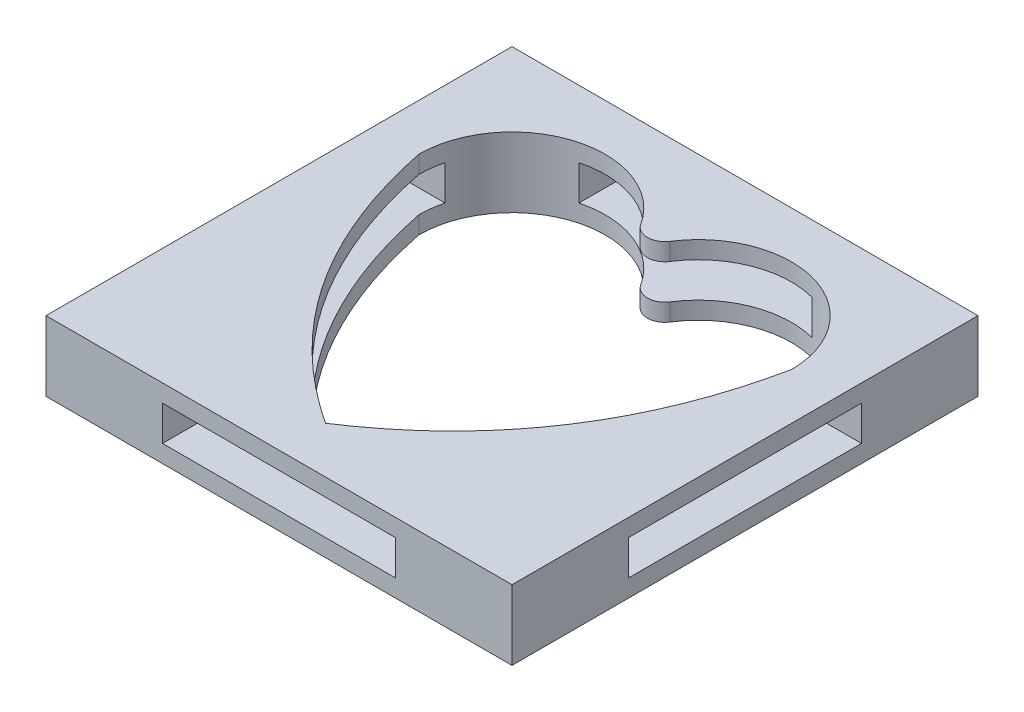
ISO-10303-21;
HEADER;
FILE_DESCRIPTION(('STEP AP214'),'2;1');
FILE_NAME('part.step','',(''),(''),'','','');
FILE_SCHEMA(('AUTOMOTIVE_DESIGN { 1 0 10303 214 1 1 1 1 }'));
ENDSEC;
DATA;
#1=APPLICATION_CONTEXT('core data for automotive mechanical design processes');
#2=APPLICATION_PROTOCOL_DEFINITION('international standard','automotive_design',2000,#1);
#3=PRODUCT_CONTEXT('',#1,'mechanical');
#4=PRODUCT('Part','Part','',(#3));
#5=PRODUCT_RELATED_PRODUCT_CATEGORY('part','',(#4));
#6=PRODUCT_DEFINITION_FORMATION('','',#4);
#7=PRODUCT_DEFINITION_CONTEXT('part definition',#1,'design');
#8=PRODUCT_DEFINITION('design','',#6,#7);
#9=PRODUCT_DEFINITION_SHAPE('','',#8);
#10=(LENGTH_UNIT() NAMED_UNIT(*) SI_UNIT(.MILLI.,.METRE.));
#11=(NAMED_UNIT(*) PLANE_ANGLE_UNIT() SI_UNIT($,.RADIAN.));
#12=(NAMED_UNIT(*) SI_UNIT($,.STERADIAN.) SOLID_ANGLE_UNIT());
#13=UNCERTAINTY_MEASURE_WITH_UNIT(LENGTH_MEASURE(1.E-05),#10,'distance_accuracy_value','');
#14=(GEOMETRIC_REPRESENTATION_CONTEXT(3) GLOBAL_UNCERTAINTY_ASSIGNED_CONTEXT((#13)) GLOBAL_UNIT_ASSIGNED_CONTEXT((#10,
#11,#12)) REPRESENTATION_CONTEXT('',''));
#15=CARTESIAN_POINT('',(0.,0.,0.));
#16=DIRECTION('',(0.,0.,1.));
#17=DIRECTION('',(1.,0.,0.));
#18=AXIS2_PLACEMENT_3D('',#15,#16,#17);
#19=CARTESIAN_POINT('',(0.,3.,-6.5617376914899));
#20=DIRECTION('',(0.,-1.,0.));
#21=DIRECTION('',(0.,0.,-1.));
#22=AXIS2_PLACEMENT_3D('',#19,#20,#21);
#23=CYLINDRICAL_SURFACE('',#22,0.75);
#24=CARTESIAN_POINT('',(0.,2.25,-6.5617376914899));
#25=DIRECTION('',(0.,1.,0.));
#26=DIRECTION('',(0.,0.,1.));
#27=AXIS2_PLACEMENT_3D('',#24,#25,#26);
#28=CIRCLE('',#27,0.75);
#29=CARTESIAN_POINT('',(0.631578947368423,2.25,-6.1572527928336));
#30=VERTEX_POINT('',#29);
#31=CARTESIAN_POINT('',(-0.631578947368421,2.25,-6.1572527928336));
#32=VERTEX_POINT('',#31);
#33=EDGE_CURVE('E302',#30,#32,#28,.F.);
#34=ORIENTED_EDGE('',*,*,#33,.F.);
#35=DIRECTION('',(0.,-1.,0.));
#36=VECTOR('',#35,1.);
#37=CARTESIAN_POINT('',(0.631578947368423,3.,-6.1572527928336));
#38=LINE('',#37,#36);
#39=CARTESIAN_POINT('',(0.631578947368423,3.,-6.1572527928336));
#40=VERTEX_POINT('',#39);
#41=EDGE_CURVE('E476',#40,#30,#38,.T.);
#42=ORIENTED_EDGE('',*,*,#41,.F.);
#43=CARTESIAN_POINT('',(0.,3.,-6.5617376914899));
#44=DIRECTION('',(0.,-1.,0.));
#45=DIRECTION('',(0.,0.,1.));
#46=AXIS2_PLACEMENT_3D('',#43,#44,#45);
#47=CIRCLE('',#46,0.75);
#48=CARTESIAN_POINT('',(-0.631578947368419,3.,-6.1572527928336));
#49=VERTEX_POINT('',#48);
#50=EDGE_CURVE('E405',#40,#49,#47,.T.);
#51=ORIENTED_EDGE('',*,*,#50,.T.);
#52=DIRECTION('',(0.,-1.,0.));
#53=VECTOR('',#52,1.);
#54=CARTESIAN_POINT('',(-0.631578947368419,3.,-6.1572527928336));
#55=LINE('',#54,#53);
#56=EDGE_CURVE('E479',#49,#32,#55,.T.);
#57=ORIENTED_EDGE('',*,*,#56,.T.);
#58=EDGE_LOOP('',(#34,#42,#51,#57));
#59=FACE_BOUND('',#58,.T.);
#60=ADVANCED_FACE('F39',(#59),#23,.T.);
#61=CARTESIAN_POINT('',(-8.,3.,-4.));
#62=CARTESIAN_POINT('',(-6.40333694662844,3.,3.8115441038304));
#63=CARTESIAN_POINT('',(0.,3.,8.));
#64=B_SPLINE_CURVE_WITH_KNOTS('',2,(#61,#62,#63),.UNSPECIFIED.,.F.,.F.,(3,3),(0.,1.),.UNSPECIFIED.);
#65=DIRECTION('',(0.,-1.,0.));
#66=VECTOR('',#65,1.);
#67=SURFACE_OF_LINEAR_EXTRUSION('',#64,#66);
#68=DIRECTION('',(0.,-1.,0.));
#69=VECTOR('',#68,1.);
#70=CARTESIAN_POINT('',(0.,3.,8.));
#71=LINE('',#70,#69);
#72=CARTESIAN_POINT('',(0.,3.,8.));
#73=VERTEX_POINT('',#72);
#74=CARTESIAN_POINT('',(0.,2.25,8.));
#75=VERTEX_POINT('',#74);
#76=EDGE_CURVE('E502',#73,#75,#71,.T.);
#77=ORIENTED_EDGE('',*,*,#76,.T.);
#78=CARTESIAN_POINT('',(-8.,2.25,-4.));
#79=CARTESIAN_POINT('',(-6.40333694662844,2.25,3.8115441038304));
#80=CARTESIAN_POINT('',(0.,2.25,8.));
#81=B_SPLINE_CURVE_WITH_KNOTS('',2,(#78,#79,#80),.UNSPECIFIED.,.F.,.F.,(3,3),(0.,1.),.UNSPECIFIED.);
#82=CARTESIAN_POINT('',(-8.,2.25,-4.));
#83=VERTEX_POINT('',#82);
#84=EDGE_CURVE('E367',#83,#75,#81,.T.);
#85=ORIENTED_EDGE('',*,*,#84,.F.);
#86=DIRECTION('',(0.,-1.,0.));
#87=VECTOR('',#86,1.);
#88=CARTESIAN_POINT('',(-8.,3.,-4.));
#89=LINE('',#88,#87);
#90=CARTESIAN_POINT('',(-8.,3.,-4.));
#91=VERTEX_POINT('',#90);
#92=EDGE_CURVE('E507',#91,#83,#89,.T.);
#93=ORIENTED_EDGE('',*,*,#92,.F.);
#94=EDGE_CURVE('E412',#91,#73,#64,.T.);
#95=ORIENTED_EDGE('',*,*,#94,.T.);
#96=EDGE_LOOP('',(#77,#85,#93,#95));
#97=FACE_BOUND('',#96,.T.);
#98=ADVANCED_FACE('F434',(#97),#67,.T.);
#99=CARTESIAN_POINT('',(0.,3.,8.));
#100=CARTESIAN_POINT('',(6.40333694662844,3.,3.81154410383039));
#101=CARTESIAN_POINT('',(8.,3.,-4.));
#102=B_SPLINE_CURVE_WITH_KNOTS('',2,(#99,#100,#101),.UNSPECIFIED.,.F.,.F.,(3,3),(0.,1.),.UNSPECIFIED.);
#103=DIRECTION('',(0.,-1.,0.));
#104=VECTOR('',#103,1.);
#105=SURFACE_OF_LINEAR_EXTRUSION('',#102,#104);
#106=CARTESIAN_POINT('',(0.,2.25,8.));
#107=CARTESIAN_POINT('',(6.40333694662844,2.25,3.81154410383039));
#108=CARTESIAN_POINT('',(8.,2.25,-4.));
#109=B_SPLINE_CURVE_WITH_KNOTS('',2,(#106,#107,#108),.UNSPECIFIED.,.F.,.F.,(3,3),(0.,1.),.UNSPECIFIED.);
#110=CARTESIAN_POINT('',(8.,2.25,-4.));
#111=VERTEX_POINT('',#110);
#112=EDGE_CURVE('E347',#75,#111,#109,.T.);
#113=ORIENTED_EDGE('',*,*,#112,.F.);
#114=ORIENTED_EDGE('',*,*,#76,.F.);
#115=CARTESIAN_POINT('',(8.,3.,-4.));
#116=VERTEX_POINT('',#115);
#117=EDGE_CURVE('E418',#73,#116,#102,.T.);
#118=ORIENTED_EDGE('',*,*,#117,.T.);
#119=DIRECTION('',(0.,-1.,0.));
#120=VECTOR('',#119,1.);
#121=CARTESIAN_POINT('',(8.,3.,-4.));
#122=LINE('',#121,#120);
#123=EDGE_CURVE('E494',#116,#111,#122,.T.);
#124=ORIENTED_EDGE('',*,*,#123,.T.);
#125=EDGE_LOOP('',(#113,#114,#118,#124));
#126=FACE_BOUND('',#125,.T.);
#127=ADVANCED_FACE('F447',(#126),#105,.T.);
#128=CARTESIAN_POINT('',(0.,3.,0.));
#129=DIRECTION('',(0.,1.,0.));
#130=DIRECTION('',(0.,0.,1.));
#131=AXIS2_PLACEMENT_3D('',#128,#129,#130);
#132=PLANE('',#131);
#133=DIRECTION('',(0.,0.,1.));
#134=VECTOR('',#133,1.);
#135=CARTESIAN_POINT('',(-10.,3.,10.));
#136=LINE('',#135,#134);
#137=CARTESIAN_POINT('',(-10.,3.,-10.));
#138=VERTEX_POINT('',#137);
#139=CARTESIAN_POINT('',(-10.,3.,10.));
#140=VERTEX_POINT('',#139);
#141=EDGE_CURVE('E515',#138,#140,#136,.T.);
#142=ORIENTED_EDGE('',*,*,#141,.T.);
#143=DIRECTION('',(1.,0.,0.));
#144=VECTOR('',#143,1.);
#145=CARTESIAN_POINT('',(10.,3.,10.));
#146=LINE('',#145,#144);
#147=CARTESIAN_POINT('',(10.,3.,10.));
#148=VERTEX_POINT('',#147);
#149=EDGE_CURVE('E519',#140,#148,#146,.T.);
#150=ORIENTED_EDGE('',*,*,#149,.T.);
#151=DIRECTION('',(0.,0.,-1.));
#152=VECTOR('',#151,1.);
#153=CARTESIAN_POINT('',(10.,3.,10.));
#154=LINE('',#153,#152);
#155=CARTESIAN_POINT('',(10.,3.,-10.));
#156=VERTEX_POINT('',#155);
#157=EDGE_CURVE('E523',#148,#156,#154,.T.);
#158=ORIENTED_EDGE('',*,*,#157,.T.);
#159=DIRECTION('',(-1.,0.,0.));
#160=VECTOR('',#159,1.);
#161=CARTESIAN_POINT('',(10.,3.,-10.));
#162=LINE('',#161,#160);
#163=EDGE_CURVE('E526',#156,#138,#162,.T.);
#164=ORIENTED_EDGE('',*,*,#163,.T.);
#165=EDGE_LOOP('',(#142,#150,#158,#164));
#166=FACE_BOUND('',#165,.T.);
#167=CARTESIAN_POINT('',(-4.,3.,-4.));
#168=DIRECTION('',(0.,1.,0.));
#169=DIRECTION('',(0.,0.,1.));
#170=AXIS2_PLACEMENT_3D('',#167,#168,#169);
#171=CIRCLE('',#170,4.);
#172=EDGE_CURVE('E408',#49,#91,#171,.T.);
#173=ORIENTED_EDGE('',*,*,#172,.F.);
#174=ORIENTED_EDGE('',*,*,#50,.F.);
#175=CARTESIAN_POINT('',(4.,3.,-4.));
#176=DIRECTION('',(0.,1.,0.));
#177=DIRECTION('',(0.,0.,1.));
#178=AXIS2_PLACEMENT_3D('',#175,#176,#177);
#179=CIRCLE('',#178,4.);
#180=EDGE_CURVE('E487',#116,#40,#179,.T.);
#181=ORIENTED_EDGE('',*,*,#180,.F.);
#182=ORIENTED_EDGE('',*,*,#117,.F.);
#183=ORIENTED_EDGE('',*,*,#94,.F.);
#184=EDGE_LOOP('',(#173,#174,#181,#182,#183));
#185=FACE_BOUND('',#184,.T.);
#186=ADVANCED_FACE('F443',(#166,#185),#132,.T.);
#187=CARTESIAN_POINT('',(0.,0.,0.));
#188=DIRECTION('',(0.,1.,0.));
#189=DIRECTION('',(0.,0.,1.));
#190=AXIS2_PLACEMENT_3D('',#187,#188,#189);
#191=PLANE('',#190);
#192=DIRECTION('',(0.,0.,1.));
#193=VECTOR('',#192,1.);
#194=CARTESIAN_POINT('',(-10.,0.,10.));
#195=LINE('',#194,#193);
#196=CARTESIAN_POINT('',(-10.,0.,-10.));
#197=VERTEX_POINT('',#196);
#198=CARTESIAN_POINT('',(-10.,0.,10.));
#199=VERTEX_POINT('',#198);
#200=EDGE_CURVE('E514',#197,#199,#195,.T.);
#201=ORIENTED_EDGE('',*,*,#200,.F.);
#202=DIRECTION('',(-1.,0.,0.));
#203=VECTOR('',#202,1.);
#204=CARTESIAN_POINT('',(10.,0.,-10.));
#205=LINE('',#204,#203);
#206=CARTESIAN_POINT('',(10.,0.,-10.));
#207=VERTEX_POINT('',#206);
#208=EDGE_CURVE('E520',#207,#197,#205,.T.);
#209=ORIENTED_EDGE('',*,*,#208,.F.);
#210=DIRECTION('',(0.,0.,-1.));
#211=VECTOR('',#210,1.);
#212=CARTESIAN_POINT('',(10.,0.,10.));
#213=LINE('',#212,#211);
#214=CARTESIAN_POINT('',(10.,0.,10.));
#215=VERTEX_POINT('',#214);
#216=EDGE_CURVE('E536',#215,#207,#213,.T.);
#217=ORIENTED_EDGE('',*,*,#216,.F.);
#218=DIRECTION('',(1.,0.,0.));
#219=VECTOR('',#218,1.);
#220=CARTESIAN_POINT('',(10.,0.,10.));
#221=LINE('',#220,#219);
#222=EDGE_CURVE('E533',#199,#215,#221,.T.);
#223=ORIENTED_EDGE('',*,*,#222,.F.);
#224=EDGE_LOOP('',(#201,#209,#217,#223));
#225=FACE_BOUND('',#224,.T.);
#226=CARTESIAN_POINT('',(0.,0.,-6.5617376914899));
#227=DIRECTION('',(0.,-1.,0.));
#228=DIRECTION('',(0.,0.,1.));
#229=AXIS2_PLACEMENT_3D('',#226,#227,#228);
#230=CIRCLE('',#229,0.75);
#231=CARTESIAN_POINT('',(0.631578947368423,0.,-6.1572527928336));
#232=VERTEX_POINT('',#231);
#233=CARTESIAN_POINT('',(-0.631578947368419,0.,-6.1572527928336));
#234=VERTEX_POINT('',#233);
#235=EDGE_CURVE('E404',#232,#234,#230,.T.);
#236=ORIENTED_EDGE('',*,*,#235,.T.);
#237=CARTESIAN_POINT('',(-4.,0.,-4.));
#238=DIRECTION('',(0.,1.,0.));
#239=DIRECTION('',(0.,0.,1.));
#240=AXIS2_PLACEMENT_3D('',#237,#238,#239);
#241=CIRCLE('',#240,4.);
#242=CARTESIAN_POINT('',(-8.,0.,-4.));
#243=VERTEX_POINT('',#242);
#244=EDGE_CURVE('E589',#234,#243,#241,.T.);
#245=ORIENTED_EDGE('',*,*,#244,.T.);
#246=CARTESIAN_POINT('',(-8.,0.,-4.));
#247=CARTESIAN_POINT('',(-6.40333694662844,0.,3.8115441038304));
#248=CARTESIAN_POINT('',(0.,0.,8.));
#249=B_SPLINE_CURVE_WITH_KNOTS('',2,(#246,#247,#248),.UNSPECIFIED.,.F.,.F.,(3,3),(0.,1.),.UNSPECIFIED.);
#250=CARTESIAN_POINT('',(0.,0.,8.));
#251=VERTEX_POINT('',#250);
#252=EDGE_CURVE('E586',#243,#251,#249,.T.);
#253=ORIENTED_EDGE('',*,*,#252,.T.);
#254=CARTESIAN_POINT('',(0.,0.,8.));
#255=CARTESIAN_POINT('',(6.40333694662844,0.,3.81154410383039));
#256=CARTESIAN_POINT('',(8.,0.,-4.));
#257=B_SPLINE_CURVE_WITH_KNOTS('',2,(#254,#255,#256),.UNSPECIFIED.,.F.,.F.,(3,3),(0.,1.),.UNSPECIFIED.);
#258=CARTESIAN_POINT('',(8.,0.,-4.));
#259=VERTEX_POINT('',#258);
#260=EDGE_CURVE('E582',#251,#259,#257,.T.);
#261=ORIENTED_EDGE('',*,*,#260,.T.);
#262=CARTESIAN_POINT('',(4.,0.,-4.));
#263=DIRECTION('',(0.,1.,0.));
#264=DIRECTION('',(0.,0.,1.));
#265=AXIS2_PLACEMENT_3D('',#262,#263,#264);
#266=CIRCLE('',#265,4.);
#267=EDGE_CURVE('E409',#259,#232,#266,.T.);
#268=ORIENTED_EDGE('',*,*,#267,.T.);
#269=EDGE_LOOP('',(#236,#245,#253,#261,#268));
#270=FACE_BOUND('',#269,.T.);
#271=ADVANCED_FACE('F446',(#225,#270),#191,.F.);
#272=CARTESIAN_POINT('',(-10.,3.,10.));
#273=DIRECTION('',(1.,0.,0.));
#274=DIRECTION('',(0.,0.,-1.));
#275=AXIS2_PLACEMENT_3D('',#272,#273,#274);
#276=PLANE('',#275);
#277=DIRECTION('',(0.,0.,-1.));
#278=VECTOR('',#277,1.);
#279=CARTESIAN_POINT('',(-10.,0.75,5.));
#280=LINE('',#279,#278);
#281=CARTESIAN_POINT('',(-10.,0.75,5.));
#282=VERTEX_POINT('',#281);
#283=CARTESIAN_POINT('',(-10.,0.75,-5.));
#284=VERTEX_POINT('',#283);
#285=EDGE_CURVE('E325',#282,#284,#280,.T.);
#286=ORIENTED_EDGE('',*,*,#285,.T.);
#287=DIRECTION('',(0.,1.,0.));
#288=VECTOR('',#287,1.);
#289=CARTESIAN_POINT('',(-10.,2.25,-5.));
#290=LINE('',#289,#288);
#291=CARTESIAN_POINT('',(-10.,2.25,-5.));
#292=VERTEX_POINT('',#291);
#293=EDGE_CURVE('E312',#284,#292,#290,.T.);
#294=ORIENTED_EDGE('',*,*,#293,.T.);
#295=DIRECTION('',(0.,0.,1.));
#296=VECTOR('',#295,1.);
#297=CARTESIAN_POINT('',(-10.,2.25,5.));
#298=LINE('',#297,#296);
#299=CARTESIAN_POINT('',(-10.,2.25,5.));
#300=VERTEX_POINT('',#299);
#301=EDGE_CURVE('E316',#292,#300,#298,.T.);
#302=ORIENTED_EDGE('',*,*,#301,.T.);
#303=DIRECTION('',(0.,-1.,0.));
#304=VECTOR('',#303,1.);
#305=CARTESIAN_POINT('',(-10.,2.25,5.));
#306=LINE('',#305,#304);
#307=EDGE_CURVE('E321',#300,#282,#306,.T.);
#308=ORIENTED_EDGE('',*,*,#307,.T.);
#309=EDGE_LOOP('',(#286,#294,#302,#308));
#310=FACE_BOUND('',#309,.T.);
#311=ORIENTED_EDGE('',*,*,#200,.T.);
#312=DIRECTION('',(0.,-1.,0.));
#313=VECTOR('',#312,1.);
#314=CARTESIAN_POINT('',(-10.,3.,10.));
#315=LINE('',#314,#313);
#316=EDGE_CURVE('E552',#140,#199,#315,.T.);
#317=ORIENTED_EDGE('',*,*,#316,.F.);
#318=ORIENTED_EDGE('',*,*,#141,.F.);
#319=DIRECTION('',(0.,-1.,0.));
#320=VECTOR('',#319,1.);
#321=CARTESIAN_POINT('',(-10.,3.,-10.));
#322=LINE('',#321,#320);
#323=EDGE_CURVE('E529',#138,#197,#322,.T.);
#324=ORIENTED_EDGE('',*,*,#323,.T.);
#325=EDGE_LOOP('',(#311,#317,#318,#324));
#326=FACE_BOUND('',#325,.T.);
#327=ADVANCED_FACE('F41',(#310,#326),#276,.F.);
#328=CARTESIAN_POINT('',(10.,3.,10.));
#329=DIRECTION('',(0.,0.,-1.));
#330=DIRECTION('',(-1.,0.,0.));
#331=AXIS2_PLACEMENT_3D('',#328,#329,#330);
#332=PLANE('',#331);
#333=DIRECTION('',(1.,0.,0.));
#334=VECTOR('',#333,1.);
#335=CARTESIAN_POINT('',(5.,0.75,10.));
#336=LINE('',#335,#334);
#337=CARTESIAN_POINT('',(-5.,0.75,10.));
#338=VERTEX_POINT('',#337);
#339=CARTESIAN_POINT('',(5.,0.75,10.));
#340=VERTEX_POINT('',#339);
#341=EDGE_CURVE('E266',#338,#340,#336,.T.);
#342=ORIENTED_EDGE('',*,*,#341,.F.);
#343=DIRECTION('',(0.,-1.,0.));
#344=VECTOR('',#343,1.);
#345=CARTESIAN_POINT('',(-5.,0.75,10.));
#346=LINE('',#345,#344);
#347=CARTESIAN_POINT('',(-5.,2.25,10.));
#348=VERTEX_POINT('',#347);
#349=EDGE_CURVE('E55',#348,#338,#346,.T.);
#350=ORIENTED_EDGE('',*,*,#349,.F.);
#351=DIRECTION('',(-1.,0.,0.));
#352=VECTOR('',#351,1.);
#353=CARTESIAN_POINT('',(5.,2.25,10.));
#354=LINE('',#353,#352);
#355=CARTESIAN_POINT('',(5.,2.25,10.));
#356=VERTEX_POINT('',#355);
#357=EDGE_CURVE('E253',#356,#348,#354,.T.);
#358=ORIENTED_EDGE('',*,*,#357,.F.);
#359=DIRECTION('',(0.,1.,0.));
#360=VECTOR('',#359,1.);
#361=CARTESIAN_POINT('',(5.,0.75,10.));
#362=LINE('',#361,#360);
#363=EDGE_CURVE('E257',#340,#356,#362,.T.);
#364=ORIENTED_EDGE('',*,*,#363,.F.);
#365=EDGE_LOOP('',(#342,#350,#358,#364));
#366=FACE_BOUND('',#365,.T.);
#367=ORIENTED_EDGE('',*,*,#222,.T.);
#368=DIRECTION('',(0.,-1.,0.));
#369=VECTOR('',#368,1.);
#370=CARTESIAN_POINT('',(10.,3.,10.));
#371=LINE('',#370,#369);
#372=EDGE_CURVE('E548',#148,#215,#371,.T.);
#373=ORIENTED_EDGE('',*,*,#372,.F.);
#374=ORIENTED_EDGE('',*,*,#149,.F.);
#375=ORIENTED_EDGE('',*,*,#316,.T.);
#376=EDGE_LOOP('',(#367,#373,#374,#375));
#377=FACE_BOUND('',#376,.T.);
#378=ADVANCED_FACE('F456',(#366,#377),#332,.F.);
#379=CARTESIAN_POINT('',(10.,3.,10.));
#380=DIRECTION('',(-1.,0.,0.));
#381=DIRECTION('',(0.,0.,1.));
#382=AXIS2_PLACEMENT_3D('',#379,#380,#381);
#383=PLANE('',#382);
#384=DIRECTION('',(0.,0.,1.));
#385=VECTOR('',#384,1.);
#386=CARTESIAN_POINT('',(10.,2.25,5.));
#387=LINE('',#386,#385);
#388=CARTESIAN_POINT('',(10.,2.25,-5.));
#389=VERTEX_POINT('',#388);
#390=CARTESIAN_POINT('',(10.,2.25,5.));
#391=VERTEX_POINT('',#390);
#392=EDGE_CURVE('E332',#389,#391,#387,.T.);
#393=ORIENTED_EDGE('',*,*,#392,.F.);
#394=DIRECTION('',(0.,1.,0.));
#395=VECTOR('',#394,1.);
#396=CARTESIAN_POINT('',(10.,2.25,-5.));
#397=LINE('',#396,#395);
#398=CARTESIAN_POINT('',(10.,0.75,-5.));
#399=VERTEX_POINT('',#398);
#400=EDGE_CURVE('E311',#399,#389,#397,.T.);
#401=ORIENTED_EDGE('',*,*,#400,.F.);
#402=DIRECTION('',(0.,0.,-1.));
#403=VECTOR('',#402,1.);
#404=CARTESIAN_POINT('',(10.,0.75,5.));
#405=LINE('',#404,#403);
#406=CARTESIAN_POINT('',(10.,0.75,5.));
#407=VERTEX_POINT('',#406);
#408=EDGE_CURVE('E317',#407,#399,#405,.T.);
#409=ORIENTED_EDGE('',*,*,#408,.F.);
#410=DIRECTION('',(0.,-1.,0.));
#411=VECTOR('',#410,1.);
#412=CARTESIAN_POINT('',(10.,2.25,5.));
#413=LINE('',#412,#411);
#414=EDGE_CURVE('E336',#391,#407,#413,.T.);
#415=ORIENTED_EDGE('',*,*,#414,.F.);
#416=EDGE_LOOP('',(#393,#401,#409,#415));
#417=FACE_BOUND('',#416,.T.);
#418=ORIENTED_EDGE('',*,*,#216,.T.);
#419=DIRECTION('',(0.,-1.,0.));
#420=VECTOR('',#419,1.);
#421=CARTESIAN_POINT('',(10.,3.,-10.));
#422=LINE('',#421,#420);
#423=EDGE_CURVE('E544',#156,#207,#422,.T.);
#424=ORIENTED_EDGE('',*,*,#423,.F.);
#425=ORIENTED_EDGE('',*,*,#157,.F.);
#426=ORIENTED_EDGE('',*,*,#372,.T.);
#427=EDGE_LOOP('',(#418,#424,#425,#426));
#428=FACE_BOUND('',#427,.T.);
#429=ADVANCED_FACE('F454',(#417,#428),#383,.F.);
#430=CARTESIAN_POINT('',(10.,3.,-10.));
#431=DIRECTION('',(0.,0.,1.));
#432=DIRECTION('',(1.,0.,0.));
#433=AXIS2_PLACEMENT_3D('',#430,#431,#432);
#434=PLANE('',#433);
#435=DIRECTION('',(-1.,0.,0.));
#436=VECTOR('',#435,1.);
#437=CARTESIAN_POINT('',(5.,2.25,-10.));
#438=LINE('',#437,#436);
#439=CARTESIAN_POINT('',(5.,2.25,-10.));
#440=VERTEX_POINT('',#439);
#441=CARTESIAN_POINT('',(-5.,2.25,-10.));
#442=VERTEX_POINT('',#441);
#443=EDGE_CURVE('E251',#440,#442,#438,.T.);
#444=ORIENTED_EDGE('',*,*,#443,.T.);
#445=DIRECTION('',(0.,-1.,0.));
#446=VECTOR('',#445,1.);
#447=CARTESIAN_POINT('',(-5.,0.75,-10.));
#448=LINE('',#447,#446);
#449=CARTESIAN_POINT('',(-5.,0.75,-10.));
#450=VERTEX_POINT('',#449);
#451=EDGE_CURVE('E231',#442,#450,#448,.T.);
#452=ORIENTED_EDGE('',*,*,#451,.T.);
#453=DIRECTION('',(1.,0.,0.));
#454=VECTOR('',#453,1.);
#455=CARTESIAN_POINT('',(5.,0.75,-10.));
#456=LINE('',#455,#454);
#457=CARTESIAN_POINT('',(5.,0.75,-10.));
#458=VERTEX_POINT('',#457);
#459=EDGE_CURVE('E242',#450,#458,#456,.T.);
#460=ORIENTED_EDGE('',*,*,#459,.T.);
#461=DIRECTION('',(0.,1.,0.));
#462=VECTOR('',#461,1.);
#463=CARTESIAN_POINT('',(5.,0.75,-10.));
#464=LINE('',#463,#462);
#465=EDGE_CURVE('E63',#458,#440,#464,.T.);
#466=ORIENTED_EDGE('',*,*,#465,.T.);
#467=EDGE_LOOP('',(#444,#452,#460,#466));
#468=FACE_BOUND('',#467,.T.);
#469=ORIENTED_EDGE('',*,*,#208,.T.);
#470=ORIENTED_EDGE('',*,*,#323,.F.);
#471=ORIENTED_EDGE('',*,*,#163,.F.);
#472=ORIENTED_EDGE('',*,*,#423,.T.);
#473=EDGE_LOOP('',(#469,#470,#471,#472));
#474=FACE_BOUND('',#473,.T.);
#475=ADVANCED_FACE('F248',(#468,#474),#434,.F.);
#476=CARTESIAN_POINT('',(0.,0.75,-6.5617376914899));
#477=DIRECTION('',(0.,-1.,0.));
#478=DIRECTION('',(1.,0.,0.));
#479=AXIS2_PLACEMENT_3D('',#476,#477,#478);
#480=CIRCLE('',#479,0.75);
#481=CARTESIAN_POINT('',(-0.631578947368421,0.75,-6.1572527928336));
#482=VERTEX_POINT('',#481);
#483=CARTESIAN_POINT('',(0.631578947368423,0.75,-6.1572527928336));
#484=VERTEX_POINT('',#483);
#485=EDGE_CURVE('E293',#482,#484,#480,.F.);
#486=ORIENTED_EDGE('',*,*,#485,.F.);
#487=EDGE_CURVE('E511',#482,#234,#55,.T.);
#488=ORIENTED_EDGE('',*,*,#487,.T.);
#489=ORIENTED_EDGE('',*,*,#235,.F.);
#490=EDGE_CURVE('E490',#484,#232,#38,.T.);
#491=ORIENTED_EDGE('',*,*,#490,.F.);
#492=EDGE_LOOP('',(#486,#488,#489,#491));
#493=FACE_BOUND('',#492,.T.);
#494=ADVANCED_FACE('F438',(#493),#23,.T.);
#495=CARTESIAN_POINT('',(-4.,3.,-4.));
#496=DIRECTION('',(0.,-1.,0.));
#497=DIRECTION('',(0.,0.,-1.));
#498=AXIS2_PLACEMENT_3D('',#495,#496,#497);
#499=CYLINDRICAL_SURFACE('',#498,4.);
#500=CARTESIAN_POINT('',(-4.,2.25,-4.));
#501=DIRECTION('',(0.,1.,0.));
#502=DIRECTION('',(0.,0.,1.));
#503=AXIS2_PLACEMENT_3D('',#500,#501,#502);
#504=CIRCLE('',#503,4.);
#505=CARTESIAN_POINT('',(-5.,2.25,-7.87298334620742));
#506=VERTEX_POINT('',#505);
#507=EDGE_CURVE('E305',#32,#506,#504,.T.);
#508=ORIENTED_EDGE('',*,*,#507,.F.);
#509=ORIENTED_EDGE('',*,*,#56,.F.);
#510=ORIENTED_EDGE('',*,*,#172,.T.);
#511=ORIENTED_EDGE('',*,*,#92,.T.);
#512=CARTESIAN_POINT('',(-4.,2.25,-4.));
#513=DIRECTION('',(0.,1.,0.));
#514=DIRECTION('',(0.,0.,1.));
#515=AXIS2_PLACEMENT_3D('',#512,#513,#514);
#516=CIRCLE('',#515,4.);
#517=CARTESIAN_POINT('',(-7.87298334620742,2.25,-5.));
#518=VERTEX_POINT('',#517);
#519=EDGE_CURVE('E376',#518,#83,#516,.T.);
#520=ORIENTED_EDGE('',*,*,#519,.F.);
#521=DIRECTION('',(0.,-1.,0.));
#522=VECTOR('',#521,1.);
#523=CARTESIAN_POINT('',(-7.87298334620742,3.,-5.));
#524=LINE('',#523,#522);
#525=CARTESIAN_POINT('',(-7.87298334620742,0.75,-5.));
#526=VERTEX_POINT('',#525);
#527=EDGE_CURVE('E401',#526,#518,#524,.F.);
#528=ORIENTED_EDGE('',*,*,#527,.F.);
#529=CARTESIAN_POINT('',(-4.,0.75,-4.));
#530=DIRECTION('',(0.,-1.,0.));
#531=DIRECTION('',(0.,0.,-1.));
#532=AXIS2_PLACEMENT_3D('',#529,#530,#531);
#533=CIRCLE('',#532,4.);
#534=CARTESIAN_POINT('',(-8.,0.75,-4.));
#535=VERTEX_POINT('',#534);
#536=EDGE_CURVE('E395',#535,#526,#533,.T.);
#537=ORIENTED_EDGE('',*,*,#536,.F.);
#538=EDGE_CURVE('E506',#535,#243,#89,.T.);
#539=ORIENTED_EDGE('',*,*,#538,.T.);
#540=ORIENTED_EDGE('',*,*,#244,.F.);
#541=ORIENTED_EDGE('',*,*,#487,.F.);
#542=CARTESIAN_POINT('',(-4.,0.75,-4.));
#543=DIRECTION('',(0.,-1.,0.));
#544=DIRECTION('',(1.,0.,0.));
#545=AXIS2_PLACEMENT_3D('',#542,#543,#544);
#546=CIRCLE('',#545,4.);
#547=CARTESIAN_POINT('',(-5.,0.75,-7.87298334620742));
#548=VERTEX_POINT('',#547);
#549=EDGE_CURVE('E296',#548,#482,#546,.T.);
#550=ORIENTED_EDGE('',*,*,#549,.F.);
#551=DIRECTION('',(0.,-1.,0.));
#552=VECTOR('',#551,1.);
#553=CARTESIAN_POINT('',(-5.,3.,-7.87298334620742));
#554=LINE('',#553,#552);
#555=EDGE_CURVE('E234',#506,#548,#554,.T.);
#556=ORIENTED_EDGE('',*,*,#555,.F.);
#557=EDGE_LOOP('',(#508,#509,#510,#511,#520,#528,#537,#539,#540,#541,#550,#556));
#558=FACE_BOUND('',#557,.T.);
#559=ADVANCED_FACE('F432',(#558),#499,.F.);
#560=CARTESIAN_POINT('',(-8.,0.75,-4.));
#561=CARTESIAN_POINT('',(-6.40333694662844,0.75,3.8115441038304));
#562=CARTESIAN_POINT('',(0.,0.75,8.));
#563=B_SPLINE_CURVE_WITH_KNOTS('',2,(#560,#561,#562),.UNSPECIFIED.,.F.,.F.,(3,3),(0.,1.),.UNSPECIFIED.);
#564=CARTESIAN_POINT('',(0.,0.75,8.));
#565=VERTEX_POINT('',#564);
#566=EDGE_CURVE('E387',#565,#535,#563,.F.);
#567=ORIENTED_EDGE('',*,*,#566,.F.);
#568=EDGE_CURVE('E501',#565,#251,#71,.T.);
#569=ORIENTED_EDGE('',*,*,#568,.T.);
#570=ORIENTED_EDGE('',*,*,#252,.F.);
#571=ORIENTED_EDGE('',*,*,#538,.F.);
#572=EDGE_LOOP('',(#567,#569,#570,#571));
#573=FACE_BOUND('',#572,.T.);
#574=ADVANCED_FACE('F427',(#573),#67,.T.);
#575=ORIENTED_EDGE('',*,*,#568,.F.);
#576=CARTESIAN_POINT('',(0.,0.75,8.));
#577=CARTESIAN_POINT('',(6.40333694662844,0.75,3.81154410383039));
#578=CARTESIAN_POINT('',(8.,0.75,-4.));
#579=B_SPLINE_CURVE_WITH_KNOTS('',2,(#576,#577,#578),.UNSPECIFIED.,.F.,.F.,(3,3),(0.,1.),.UNSPECIFIED.);
#580=CARTESIAN_POINT('',(8.,0.75,-4.));
#581=VERTEX_POINT('',#580);
#582=EDGE_CURVE('E382',#581,#565,#579,.F.);
#583=ORIENTED_EDGE('',*,*,#582,.F.);
#584=EDGE_CURVE('E489',#581,#259,#122,.T.);
#585=ORIENTED_EDGE('',*,*,#584,.T.);
#586=ORIENTED_EDGE('',*,*,#260,.F.);
#587=EDGE_LOOP('',(#575,#583,#585,#586));
#588=FACE_BOUND('',#587,.T.);
#589=ADVANCED_FACE('F431',(#588),#105,.T.);
#590=CARTESIAN_POINT('',(4.,3.,-4.));
#591=DIRECTION('',(0.,-1.,0.));
#592=DIRECTION('',(0.,0.,-1.));
#593=AXIS2_PLACEMENT_3D('',#590,#591,#592);
#594=CYLINDRICAL_SURFACE('',#593,4.);
#595=CARTESIAN_POINT('',(4.,2.25,-4.));
#596=DIRECTION('',(0.,1.,0.));
#597=DIRECTION('',(0.,0.,1.));
#598=AXIS2_PLACEMENT_3D('',#595,#596,#597);
#599=CIRCLE('',#598,4.);
#600=CARTESIAN_POINT('',(5.,2.25,-7.87298334620742));
#601=VERTEX_POINT('',#600);
#602=EDGE_CURVE('E299',#601,#30,#599,.T.);
#603=ORIENTED_EDGE('',*,*,#602,.F.);
#604=DIRECTION('',(0.,-1.,0.));
#605=VECTOR('',#604,1.);
#606=CARTESIAN_POINT('',(5.,3.,-7.87298334620742));
#607=LINE('',#606,#605);
#608=CARTESIAN_POINT('',(5.,0.75,-7.87298334620742));
#609=VERTEX_POINT('',#608);
#610=EDGE_CURVE('E308',#609,#601,#607,.F.);
#611=ORIENTED_EDGE('',*,*,#610,.F.);
#612=CARTESIAN_POINT('',(4.,0.75,-4.));
#613=DIRECTION('',(0.,-1.,0.));
#614=DIRECTION('',(1.,0.,0.));
#615=AXIS2_PLACEMENT_3D('',#612,#613,#614);
#616=CIRCLE('',#615,4.);
#617=EDGE_CURVE('E290',#484,#609,#616,.T.);
#618=ORIENTED_EDGE('',*,*,#617,.F.);
#619=ORIENTED_EDGE('',*,*,#490,.T.);
#620=ORIENTED_EDGE('',*,*,#267,.F.);
#621=ORIENTED_EDGE('',*,*,#584,.F.);
#622=CARTESIAN_POINT('',(4.,0.75,-4.));
#623=DIRECTION('',(0.,-1.,0.));
#624=DIRECTION('',(0.,0.,-1.));
#625=AXIS2_PLACEMENT_3D('',#622,#623,#624);
#626=CIRCLE('',#625,4.);
#627=CARTESIAN_POINT('',(7.87298334620742,0.75,-5.));
#628=VERTEX_POINT('',#627);
#629=EDGE_CURVE('E48',#628,#581,#626,.T.);
#630=ORIENTED_EDGE('',*,*,#629,.F.);
#631=DIRECTION('',(0.,-1.,0.));
#632=VECTOR('',#631,1.);
#633=CARTESIAN_POINT('',(7.87298334620742,3.,-5.));
#634=LINE('',#633,#632);
#635=CARTESIAN_POINT('',(7.87298334620742,2.25,-5.));
#636=VERTEX_POINT('',#635);
#637=EDGE_CURVE('E559',#636,#628,#634,.T.);
#638=ORIENTED_EDGE('',*,*,#637,.F.);
#639=CARTESIAN_POINT('',(4.,2.25,-4.));
#640=DIRECTION('',(0.,1.,0.));
#641=DIRECTION('',(0.,0.,1.));
#642=AXIS2_PLACEMENT_3D('',#639,#640,#641);
#643=CIRCLE('',#642,4.);
#644=EDGE_CURVE('E556',#111,#636,#643,.T.);
#645=ORIENTED_EDGE('',*,*,#644,.F.);
#646=ORIENTED_EDGE('',*,*,#123,.F.);
#647=ORIENTED_EDGE('',*,*,#180,.T.);
#648=ORIENTED_EDGE('',*,*,#41,.T.);
#649=EDGE_LOOP('',(#603,#611,#618,#619,#620,#621,#630,#638,#645,#646,#647,#648));
#650=FACE_BOUND('',#649,.T.);
#651=ADVANCED_FACE('F484',(#650),#594,.F.);
#652=CARTESIAN_POINT('',(-10.,2.25,-5.));
#653=DIRECTION('',(0.,0.,-1.));
#654=DIRECTION('',(-1.,0.,0.));
#655=AXIS2_PLACEMENT_3D('',#652,#653,#654);
#656=PLANE('',#655);
#657=ORIENTED_EDGE('',*,*,#637,.T.);
#658=DIRECTION('',(1.,0.,0.));
#659=VECTOR('',#658,1.);
#660=CARTESIAN_POINT('',(-10.,0.75,-5.));
#661=LINE('',#660,#659);
#662=EDGE_CURVE('E348',#628,#399,#661,.T.);
#663=ORIENTED_EDGE('',*,*,#662,.T.);
#664=ORIENTED_EDGE('',*,*,#400,.T.);
#665=DIRECTION('',(1.,0.,0.));
#666=VECTOR('',#665,1.);
#667=CARTESIAN_POINT('',(-10.,2.25,-5.));
#668=LINE('',#667,#666);
#669=EDGE_CURVE('E329',#636,#389,#668,.T.);
#670=ORIENTED_EDGE('',*,*,#669,.F.);
#671=EDGE_LOOP('',(#657,#663,#664,#670));
#672=FACE_BOUND('',#671,.T.);
#673=ADVANCED_FACE('F667',(#672),#656,.F.);
#674=CARTESIAN_POINT('',(-10.,2.25,5.));
#675=DIRECTION('',(0.,0.,1.));
#676=DIRECTION('',(0.,-1.,0.));
#677=AXIS2_PLACEMENT_3D('',#674,#675,#676);
#678=PLANE('',#677);
#679=DIRECTION('',(1.,0.,0.));
#680=VECTOR('',#679,1.);
#681=CARTESIAN_POINT('',(-10.,0.75,5.));
#682=LINE('',#681,#680);
#683=CARTESIAN_POINT('',(5.,0.75,5.));
#684=VERTEX_POINT('',#683);
#685=EDGE_CURVE('E353',#684,#407,#682,.T.);
#686=ORIENTED_EDGE('',*,*,#685,.F.);
#687=DIRECTION('',(0.,1.,0.));
#688=VECTOR('',#687,1.);
#689=CARTESIAN_POINT('',(5.,2.25,5.));
#690=LINE('',#689,#688);
#691=CARTESIAN_POINT('',(5.,2.25,5.));
#692=VERTEX_POINT('',#691);
#693=EDGE_CURVE('E11',#684,#692,#690,.T.);
#694=ORIENTED_EDGE('',*,*,#693,.T.);
#695=DIRECTION('',(1.,0.,0.));
#696=VECTOR('',#695,1.);
#697=CARTESIAN_POINT('',(-10.,2.25,5.));
#698=LINE('',#697,#696);
#699=EDGE_CURVE('E358',#692,#391,#698,.T.);
#700=ORIENTED_EDGE('',*,*,#699,.T.);
#701=ORIENTED_EDGE('',*,*,#414,.T.);
#702=EDGE_LOOP('',(#686,#694,#700,#701));
#703=FACE_BOUND('',#702,.T.);
#704=ADVANCED_FACE('F652',(#703),#678,.F.);
#705=CARTESIAN_POINT('',(-5.,2.25,5.));
#706=VERTEX_POINT('',#705);
#707=EDGE_CURVE('E354',#300,#706,#698,.T.);
#708=ORIENTED_EDGE('',*,*,#707,.T.);
#709=DIRECTION('',(0.,-1.,0.));
#710=VECTOR('',#709,1.);
#711=CARTESIAN_POINT('',(-5.,2.25,5.));
#712=LINE('',#711,#710);
#713=CARTESIAN_POINT('',(-5.,0.75,5.));
#714=VERTEX_POINT('',#713);
#715=EDGE_CURVE('E276',#706,#714,#712,.T.);
#716=ORIENTED_EDGE('',*,*,#715,.T.);
#717=EDGE_CURVE('E349',#282,#714,#682,.T.);
#718=ORIENTED_EDGE('',*,*,#717,.F.);
#719=ORIENTED_EDGE('',*,*,#307,.F.);
#720=EDGE_LOOP('',(#708,#716,#718,#719));
#721=FACE_BOUND('',#720,.T.);
#722=ADVANCED_FACE('F639',(#721),#678,.F.);
#723=ORIENTED_EDGE('',*,*,#527,.T.);
#724=EDGE_CURVE('E359',#292,#518,#668,.T.);
#725=ORIENTED_EDGE('',*,*,#724,.F.);
#726=ORIENTED_EDGE('',*,*,#293,.F.);
#727=EDGE_CURVE('E343',#284,#526,#661,.T.);
#728=ORIENTED_EDGE('',*,*,#727,.T.);
#729=EDGE_LOOP('',(#723,#725,#726,#728));
#730=FACE_BOUND('',#729,.T.);
#731=ADVANCED_FACE('F629',(#730),#656,.F.);
#732=CARTESIAN_POINT('',(-10.,0.75,5.));
#733=DIRECTION('',(0.,-1.,0.));
#734=DIRECTION('',(0.,0.,-1.));
#735=AXIS2_PLACEMENT_3D('',#732,#733,#734);
#736=PLANE('',#735);
#737=ORIENTED_EDGE('',*,*,#717,.T.);
#738=DIRECTION('',(0.,0.,1.));
#739=VECTOR('',#738,1.);
#740=CARTESIAN_POINT('',(-5.,0.75,-10.));
#741=LINE('',#740,#739);
#742=EDGE_CURVE('E239',#714,#338,#741,.T.);
#743=ORIENTED_EDGE('',*,*,#742,.T.);
#744=ORIENTED_EDGE('',*,*,#341,.T.);
#745=DIRECTION('',(0.,0.,1.));
#746=VECTOR('',#745,1.);
#747=CARTESIAN_POINT('',(5.,0.75,-10.));
#748=LINE('',#747,#746);
#749=EDGE_CURVE('E238',#684,#340,#748,.T.);
#750=ORIENTED_EDGE('',*,*,#749,.F.);
#751=ORIENTED_EDGE('',*,*,#685,.T.);
#752=ORIENTED_EDGE('',*,*,#408,.T.);
#753=ORIENTED_EDGE('',*,*,#662,.F.);
#754=ORIENTED_EDGE('',*,*,#629,.T.);
#755=ORIENTED_EDGE('',*,*,#582,.T.);
#756=ORIENTED_EDGE('',*,*,#566,.T.);
#757=ORIENTED_EDGE('',*,*,#536,.T.);
#758=ORIENTED_EDGE('',*,*,#727,.F.);
#759=ORIENTED_EDGE('',*,*,#285,.F.);
#760=EDGE_LOOP('',(#737,#743,#744,#750,#751,#752,#753,#754,#755,#756,#757,#758,#759));
#761=FACE_BOUND('',#760,.T.);
#762=ADVANCED_FACE('F566',(#761),#736,.F.);
#763=CARTESIAN_POINT('',(-10.,2.25,5.));
#764=DIRECTION('',(0.,1.,0.));
#765=DIRECTION('',(0.,0.,1.));
#766=AXIS2_PLACEMENT_3D('',#763,#764,#765);
#767=PLANE('',#766);
#768=ORIENTED_EDGE('',*,*,#84,.T.);
#769=ORIENTED_EDGE('',*,*,#112,.T.);
#770=ORIENTED_EDGE('',*,*,#644,.T.);
#771=ORIENTED_EDGE('',*,*,#669,.T.);
#772=ORIENTED_EDGE('',*,*,#392,.T.);
#773=ORIENTED_EDGE('',*,*,#699,.F.);
#774=DIRECTION('',(0.,0.,1.));
#775=VECTOR('',#774,1.);
#776=CARTESIAN_POINT('',(5.,2.25,-10.));
#777=LINE('',#776,#775);
#778=EDGE_CURVE('E282',#692,#356,#777,.T.);
#779=ORIENTED_EDGE('',*,*,#778,.T.);
#780=ORIENTED_EDGE('',*,*,#357,.T.);
#781=DIRECTION('',(0.,0.,1.));
#782=VECTOR('',#781,1.);
#783=CARTESIAN_POINT('',(-5.,2.25,-10.));
#784=LINE('',#783,#782);
#785=EDGE_CURVE('E277',#706,#348,#784,.T.);
#786=ORIENTED_EDGE('',*,*,#785,.F.);
#787=ORIENTED_EDGE('',*,*,#707,.F.);
#788=ORIENTED_EDGE('',*,*,#301,.F.);
#789=ORIENTED_EDGE('',*,*,#724,.T.);
#790=ORIENTED_EDGE('',*,*,#519,.T.);
#791=EDGE_LOOP('',(#768,#769,#770,#771,#772,#773,#779,#780,#786,#787,#788,#789,#790));
#792=FACE_BOUND('',#791,.T.);
#793=ADVANCED_FACE('F633',(#792),#767,.F.);
#794=CARTESIAN_POINT('',(-5.,0.75,-10.));
#795=DIRECTION('',(-1.,0.,0.));
#796=DIRECTION('',(0.,0.,1.));
#797=AXIS2_PLACEMENT_3D('',#794,#795,#796);
#798=PLANE('',#797);
#799=ORIENTED_EDGE('',*,*,#785,.T.);
#800=ORIENTED_EDGE('',*,*,#349,.T.);
#801=ORIENTED_EDGE('',*,*,#742,.F.);
#802=ORIENTED_EDGE('',*,*,#715,.F.);
#803=EDGE_LOOP('',(#799,#800,#801,#802));
#804=FACE_BOUND('',#803,.T.);
#805=ADVANCED_FACE('F640',(#804),#798,.F.);
#806=CARTESIAN_POINT('',(5.,0.75,-10.));
#807=DIRECTION('',(1.,0.,0.));
#808=DIRECTION('',(0.,0.,-1.));
#809=AXIS2_PLACEMENT_3D('',#806,#807,#808);
#810=PLANE('',#809);
#811=ORIENTED_EDGE('',*,*,#749,.T.);
#812=ORIENTED_EDGE('',*,*,#363,.T.);
#813=ORIENTED_EDGE('',*,*,#778,.F.);
#814=ORIENTED_EDGE('',*,*,#693,.F.);
#815=EDGE_LOOP('',(#811,#812,#813,#814));
#816=FACE_BOUND('',#815,.T.);
#817=ADVANCED_FACE('F648',(#816),#810,.F.);
#818=CARTESIAN_POINT('',(5.,0.75,-10.));
#819=DIRECTION('',(0.,-1.,0.));
#820=DIRECTION('',(1.,0.,0.));
#821=AXIS2_PLACEMENT_3D('',#818,#819,#820);
#822=PLANE('',#821);
#823=ORIENTED_EDGE('',*,*,#549,.T.);
#824=ORIENTED_EDGE('',*,*,#485,.T.);
#825=ORIENTED_EDGE('',*,*,#617,.T.);
#826=EDGE_CURVE('E244',#458,#609,#748,.T.);
#827=ORIENTED_EDGE('',*,*,#826,.F.);
#828=ORIENTED_EDGE('',*,*,#459,.F.);
#829=EDGE_CURVE('E226',#450,#548,#741,.T.);
#830=ORIENTED_EDGE('',*,*,#829,.T.);
#831=EDGE_LOOP('',(#823,#824,#825,#827,#828,#830));
#832=FACE_BOUND('',#831,.T.);
#833=ADVANCED_FACE('F243',(#832),#822,.F.);
#834=ORIENTED_EDGE('',*,*,#555,.T.);
#835=ORIENTED_EDGE('',*,*,#829,.F.);
#836=ORIENTED_EDGE('',*,*,#451,.F.);
#837=EDGE_CURVE('E273',#442,#506,#784,.T.);
#838=ORIENTED_EDGE('',*,*,#837,.T.);
#839=EDGE_LOOP('',(#834,#835,#836,#838));
#840=FACE_BOUND('',#839,.T.);
#841=ADVANCED_FACE('F228',(#840),#798,.F.);
#842=CARTESIAN_POINT('',(5.,2.25,-10.));
#843=DIRECTION('',(0.,1.,0.));
#844=DIRECTION('',(0.,0.,1.));
#845=AXIS2_PLACEMENT_3D('',#842,#843,#844);
#846=PLANE('',#845);
#847=ORIENTED_EDGE('',*,*,#507,.T.);
#848=ORIENTED_EDGE('',*,*,#837,.F.);
#849=ORIENTED_EDGE('',*,*,#443,.F.);
#850=EDGE_CURVE('E278',#440,#601,#777,.T.);
#851=ORIENTED_EDGE('',*,*,#850,.T.);
#852=ORIENTED_EDGE('',*,*,#602,.T.);
#853=ORIENTED_EDGE('',*,*,#33,.T.);
#854=EDGE_LOOP('',(#847,#848,#849,#851,#852,#853));
#855=FACE_BOUND('',#854,.T.);
#856=ADVANCED_FACE('F615',(#855),#846,.F.);
#857=ORIENTED_EDGE('',*,*,#610,.T.);
#858=ORIENTED_EDGE('',*,*,#850,.F.);
#859=ORIENTED_EDGE('',*,*,#465,.F.);
#860=ORIENTED_EDGE('',*,*,#826,.T.);
#861=EDGE_LOOP('',(#857,#858,#859,#860));
#862=FACE_BOUND('',#861,.T.);
#863=ADVANCED_FACE('F616',(#862),#810,.F.);
#864=CLOSED_SHELL('',(#60,#98,#127,#186,#271,#327,#378,#429,#475,#494,#559,#574,#589,#651,#673,
#704,#722,#731,#762,#793,#805,#817,#833,#841,#856,#863));
#865=MANIFOLD_SOLID_BREP('B2',#864);
#866=ADVANCED_BREP_SHAPE_REPRESENTATION('',(#18,#865),#14);
#867=SHAPE_DEFINITION_REPRESENTATION(#9,#866);
ENDSEC;
END-ISO-10303-21;
